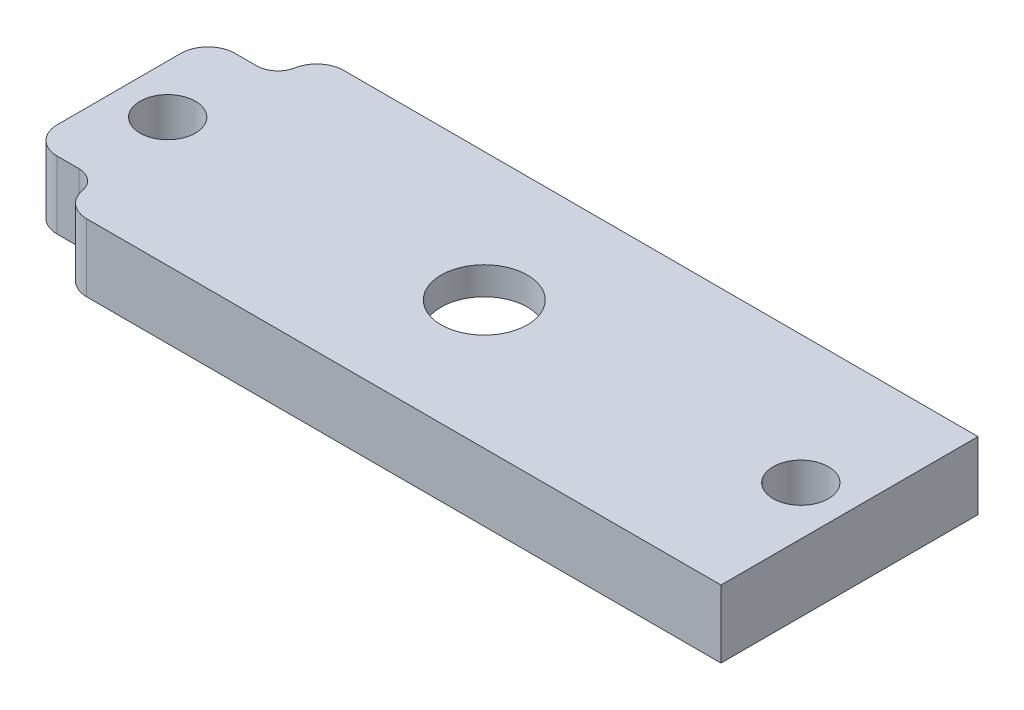
ISO-10303-21;
HEADER;
FILE_DESCRIPTION(('STEP AP214'),'2;1');
FILE_NAME('part.step','',(''),(''),'','','');
FILE_SCHEMA(('AUTOMOTIVE_DESIGN { 1 0 10303 214 1 1 1 1 }'));
ENDSEC;
DATA;
#1=APPLICATION_CONTEXT('core data for automotive mechanical design processes');
#2=APPLICATION_PROTOCOL_DEFINITION('international standard','automotive_design',2000,#1);
#3=PRODUCT_CONTEXT('',#1,'mechanical');
#4=PRODUCT('Part','Part','',(#3));
#5=PRODUCT_RELATED_PRODUCT_CATEGORY('part','',(#4));
#6=PRODUCT_DEFINITION_FORMATION('','',#4);
#7=PRODUCT_DEFINITION_CONTEXT('part definition',#1,'design');
#8=PRODUCT_DEFINITION('design','',#6,#7);
#9=PRODUCT_DEFINITION_SHAPE('','',#8);
#10=(LENGTH_UNIT() NAMED_UNIT(*) SI_UNIT(.MILLI.,.METRE.));
#11=(NAMED_UNIT(*) PLANE_ANGLE_UNIT() SI_UNIT($,.RADIAN.));
#12=(NAMED_UNIT(*) SI_UNIT($,.STERADIAN.) SOLID_ANGLE_UNIT());
#13=UNCERTAINTY_MEASURE_WITH_UNIT(LENGTH_MEASURE(1.E-05),#10,'distance_accuracy_value','');
#14=(GEOMETRIC_REPRESENTATION_CONTEXT(3) GLOBAL_UNCERTAINTY_ASSIGNED_CONTEXT((#13)) GLOBAL_UNIT_ASSIGNED_CONTEXT((#10,
#11,#12)) REPRESENTATION_CONTEXT('',''));
#15=CARTESIAN_POINT('',(0.,0.,0.));
#16=DIRECTION('',(0.,0.,1.));
#17=DIRECTION('',(1.,0.,0.));
#18=AXIS2_PLACEMENT_3D('',#15,#16,#17);
#19=CARTESIAN_POINT('',(0.,6.35,0.));
#20=DIRECTION('',(0.,-1.,0.));
#21=DIRECTION('',(0.,0.,-1.));
#22=AXIS2_PLACEMENT_3D('',#19,#20,#21);
#23=PLANE('',#22);
#24=CARTESIAN_POINT('',(34.29,6.35,-12.065));
#25=DIRECTION('',(0.,1.,0.));
#26=DIRECTION('',(0.,0.,1.));
#27=AXIS2_PLACEMENT_3D('',#24,#25,#26);
#28=CIRCLE('',#27,4.05);
#29=CARTESIAN_POINT('',(34.29,6.35,-8.015));
#30=VERTEX_POINT('',#29);
#31=EDGE_CURVE('E154',#30,#30,#28,.T.);
#32=ORIENTED_EDGE('',*,*,#31,.F.);
#33=EDGE_LOOP('',(#32));
#34=FACE_BOUND('',#33,.T.);
#35=CARTESIAN_POINT('',(4.57,6.35,-12.065));
#36=DIRECTION('',(0.,1.,0.));
#37=DIRECTION('',(0.,0.,1.));
#38=AXIS2_PLACEMENT_3D('',#35,#36,#37);
#39=CIRCLE('',#38,2.6);
#40=CARTESIAN_POINT('',(4.57,6.35,-9.465));
#41=VERTEX_POINT('',#40);
#42=EDGE_CURVE('E176',#41,#41,#39,.T.);
#43=ORIENTED_EDGE('',*,*,#42,.F.);
#44=EDGE_LOOP('',(#43));
#45=FACE_BOUND('',#44,.T.);
#46=CARTESIAN_POINT('',(64.01,6.35,-12.065));
#47=DIRECTION('',(0.,1.,0.));
#48=DIRECTION('',(0.,0.,1.));
#49=AXIS2_PLACEMENT_3D('',#46,#47,#48);
#50=CIRCLE('',#49,2.59999999999999);
#51=CARTESIAN_POINT('',(64.01,6.35,-9.46500000000001));
#52=VERTEX_POINT('',#51);
#53=EDGE_CURVE('E170',#52,#52,#50,.T.);
#54=ORIENTED_EDGE('',*,*,#53,.F.);
#55=EDGE_LOOP('',(#54));
#56=FACE_BOUND('',#55,.T.);
#57=CARTESIAN_POINT('',(4.57,6.35,-1.715));
#58=DIRECTION('',(0.,1.,0.));
#59=DIRECTION('',(0.,0.,1.));
#60=AXIS2_PLACEMENT_3D('',#57,#58,#59);
#61=CIRCLE('',#60,2.);
#62=CARTESIAN_POINT('',(4.57,6.35,-3.715));
#63=VERTEX_POINT('',#62);
#64=CARTESIAN_POINT('',(6.53670134597141,6.35,-2.07843612334802));
#65=VERTEX_POINT('',#64);
#66=EDGE_CURVE('E139',#63,#65,#61,.F.);
#67=ORIENTED_EDGE('',*,*,#66,.T.);
#68=CARTESIAN_POINT('',(9.03441205535511,6.35,-2.54));
#69=DIRECTION('',(0.,-1.,0.));
#70=DIRECTION('',(0.,0.,-1.));
#71=AXIS2_PLACEMENT_3D('',#68,#69,#70);
#72=CIRCLE('',#71,2.54);
#73=CARTESIAN_POINT('',(9.03441205535511,6.35,0.));
#74=VERTEX_POINT('',#73);
#75=EDGE_CURVE('E215',#65,#74,#72,.F.);
#76=ORIENTED_EDGE('',*,*,#75,.T.);
#77=DIRECTION('',(1.,0.,0.));
#78=VECTOR('',#77,1.);
#79=CARTESIAN_POINT('',(0.,6.35,0.));
#80=LINE('',#79,#78);
#81=CARTESIAN_POINT('',(68.58,6.35,0.));
#82=VERTEX_POINT('',#81);
#83=EDGE_CURVE('E185',#74,#82,#80,.T.);
#84=ORIENTED_EDGE('',*,*,#83,.T.);
#85=DIRECTION('',(0.,0.,-1.));
#86=VECTOR('',#85,1.);
#87=CARTESIAN_POINT('',(68.58,6.35,0.));
#88=LINE('',#87,#86);
#89=CARTESIAN_POINT('',(68.58,6.35,-24.13));
#90=VERTEX_POINT('',#89);
#91=EDGE_CURVE('E188',#82,#90,#88,.T.);
#92=ORIENTED_EDGE('',*,*,#91,.T.);
#93=DIRECTION('',(-1.,0.,0.));
#94=VECTOR('',#93,1.);
#95=CARTESIAN_POINT('',(0.,6.35,-24.13));
#96=LINE('',#95,#94);
#97=CARTESIAN_POINT('',(9.03441205535511,6.35,-24.13));
#98=VERTEX_POINT('',#97);
#99=EDGE_CURVE('E190',#90,#98,#96,.T.);
#100=ORIENTED_EDGE('',*,*,#99,.T.);
#101=CARTESIAN_POINT('',(9.03441205535511,6.35,-21.59));
#102=DIRECTION('',(0.,-1.,0.));
#103=DIRECTION('',(0.,0.,-1.));
#104=AXIS2_PLACEMENT_3D('',#101,#102,#103);
#105=CIRCLE('',#104,2.54);
#106=CARTESIAN_POINT('',(6.53670134597141,6.35,-22.051563876652));
#107=VERTEX_POINT('',#106);
#108=EDGE_CURVE('E209',#98,#107,#105,.F.);
#109=ORIENTED_EDGE('',*,*,#108,.T.);
#110=CARTESIAN_POINT('',(4.57,6.35,-22.415));
#111=DIRECTION('',(0.,1.,0.));
#112=DIRECTION('',(0.,0.,1.));
#113=AXIS2_PLACEMENT_3D('',#110,#111,#112);
#114=CIRCLE('',#113,2.);
#115=CARTESIAN_POINT('',(4.57,6.35,-20.415));
#116=VERTEX_POINT('',#115);
#117=EDGE_CURVE('E150',#116,#107,#114,.T.);
#118=ORIENTED_EDGE('',*,*,#117,.F.);
#119=DIRECTION('',(-1.,0.,0.));
#120=VECTOR('',#119,1.);
#121=CARTESIAN_POINT('',(0.,6.35,-20.415));
#122=LINE('',#121,#120);
#123=CARTESIAN_POINT('',(2.54,6.35,-20.415));
#124=VERTEX_POINT('',#123);
#125=EDGE_CURVE('E135',#116,#124,#122,.T.);
#126=ORIENTED_EDGE('',*,*,#125,.T.);
#127=CARTESIAN_POINT('',(2.54,6.35,-17.875));
#128=DIRECTION('',(0.,-1.,0.));
#129=DIRECTION('',(0.,0.,-1.));
#130=AXIS2_PLACEMENT_3D('',#127,#128,#129);
#131=CIRCLE('',#130,2.54);
#132=CARTESIAN_POINT('',(0.,6.35,-17.875));
#133=VERTEX_POINT('',#132);
#134=EDGE_CURVE('E211',#124,#133,#131,.F.);
#135=ORIENTED_EDGE('',*,*,#134,.T.);
#136=DIRECTION('',(0.,0.,1.));
#137=VECTOR('',#136,1.);
#138=CARTESIAN_POINT('',(0.,6.35,0.));
#139=LINE('',#138,#137);
#140=CARTESIAN_POINT('',(0.,6.35,-6.255));
#141=VERTEX_POINT('',#140);
#142=EDGE_CURVE('E182',#133,#141,#139,.T.);
#143=ORIENTED_EDGE('',*,*,#142,.T.);
#144=CARTESIAN_POINT('',(2.54,6.35,-6.255));
#145=DIRECTION('',(0.,-1.,0.));
#146=DIRECTION('',(0.,0.,-1.));
#147=AXIS2_PLACEMENT_3D('',#144,#145,#146);
#148=CIRCLE('',#147,2.54);
#149=CARTESIAN_POINT('',(2.54,6.35,-3.715));
#150=VERTEX_POINT('',#149);
#151=EDGE_CURVE('E213',#141,#150,#148,.F.);
#152=ORIENTED_EDGE('',*,*,#151,.T.);
#153=DIRECTION('',(-1.,0.,0.));
#154=VECTOR('',#153,1.);
#155=CARTESIAN_POINT('',(0.,6.35,-3.715));
#156=LINE('',#155,#154);
#157=EDGE_CURVE('E162',#63,#150,#156,.T.);
#158=ORIENTED_EDGE('',*,*,#157,.F.);
#159=EDGE_LOOP('',(#67,#76,#84,#92,#100,#109,#118,#126,#135,#143,#152,#158));
#160=FACE_BOUND('',#159,.T.);
#161=ADVANCED_FACE('F34',(#34,#45,#56,#160),#23,.F.);
#162=CARTESIAN_POINT('',(0.,0.,0.));
#163=DIRECTION('',(0.,-1.,0.));
#164=DIRECTION('',(0.,0.,-1.));
#165=AXIS2_PLACEMENT_3D('',#162,#163,#164);
#166=PLANE('',#165);
#167=CARTESIAN_POINT('',(34.29,0.,-12.065));
#168=DIRECTION('',(0.,1.,0.));
#169=DIRECTION('',(0.,0.,1.));
#170=AXIS2_PLACEMENT_3D('',#167,#168,#169);
#171=CIRCLE('',#170,10.065);
#172=CARTESIAN_POINT('',(34.29,0.,-2.));
#173=VERTEX_POINT('',#172);
#174=EDGE_CURVE('E436',#173,#173,#171,.T.);
#175=ORIENTED_EDGE('',*,*,#174,.T.);
#176=EDGE_LOOP('',(#175));
#177=FACE_BOUND('',#176,.T.);
#178=CARTESIAN_POINT('',(4.57,0.,-12.065));
#179=DIRECTION('',(0.,1.,0.));
#180=DIRECTION('',(0.,0.,1.));
#181=AXIS2_PLACEMENT_3D('',#178,#179,#180);
#182=CIRCLE('',#181,2.6);
#183=CARTESIAN_POINT('',(4.57,0.,-9.465));
#184=VERTEX_POINT('',#183);
#185=EDGE_CURVE('E173',#184,#184,#182,.T.);
#186=ORIENTED_EDGE('',*,*,#185,.T.);
#187=EDGE_LOOP('',(#186));
#188=FACE_BOUND('',#187,.T.);
#189=CARTESIAN_POINT('',(64.01,0.,-12.065));
#190=DIRECTION('',(0.,1.,0.));
#191=DIRECTION('',(0.,0.,1.));
#192=AXIS2_PLACEMENT_3D('',#189,#190,#191);
#193=CIRCLE('',#192,2.59999999999999);
#194=CARTESIAN_POINT('',(64.01,0.,-9.46500000000001));
#195=VERTEX_POINT('',#194);
#196=EDGE_CURVE('E169',#195,#195,#193,.T.);
#197=ORIENTED_EDGE('',*,*,#196,.T.);
#198=EDGE_LOOP('',(#197));
#199=FACE_BOUND('',#198,.T.);
#200=DIRECTION('',(1.,0.,0.));
#201=VECTOR('',#200,1.);
#202=CARTESIAN_POINT('',(0.,0.,0.));
#203=LINE('',#202,#201);
#204=CARTESIAN_POINT('',(9.03441205535511,0.,0.));
#205=VERTEX_POINT('',#204);
#206=CARTESIAN_POINT('',(68.58,0.,0.));
#207=VERTEX_POINT('',#206);
#208=EDGE_CURVE('E196',#205,#207,#203,.T.);
#209=ORIENTED_EDGE('',*,*,#208,.F.);
#210=CARTESIAN_POINT('',(9.03441205535511,0.,-2.54));
#211=DIRECTION('',(0.,-1.,0.));
#212=DIRECTION('',(0.,0.,-1.));
#213=AXIS2_PLACEMENT_3D('',#210,#211,#212);
#214=CIRCLE('',#213,2.54);
#215=CARTESIAN_POINT('',(6.53670134597141,0.,-2.07843612334802));
#216=VERTEX_POINT('',#215);
#217=EDGE_CURVE('E223',#205,#216,#214,.T.);
#218=ORIENTED_EDGE('',*,*,#217,.T.);
#219=CARTESIAN_POINT('',(4.57,0.,-1.715));
#220=DIRECTION('',(0.,1.,0.));
#221=DIRECTION('',(0.,0.,1.));
#222=AXIS2_PLACEMENT_3D('',#219,#220,#221);
#223=CIRCLE('',#222,2.);
#224=CARTESIAN_POINT('',(4.57,0.,-3.715));
#225=VERTEX_POINT('',#224);
#226=EDGE_CURVE('E158',#225,#216,#223,.F.);
#227=ORIENTED_EDGE('',*,*,#226,.F.);
#228=DIRECTION('',(-1.,0.,0.));
#229=VECTOR('',#228,1.);
#230=CARTESIAN_POINT('',(0.,0.,-3.715));
#231=LINE('',#230,#229);
#232=CARTESIAN_POINT('',(2.54,0.,-3.715));
#233=VERTEX_POINT('',#232);
#234=EDGE_CURVE('E161',#225,#233,#231,.T.);
#235=ORIENTED_EDGE('',*,*,#234,.T.);
#236=CARTESIAN_POINT('',(2.54,0.,-6.255));
#237=DIRECTION('',(0.,-1.,0.));
#238=DIRECTION('',(0.,0.,-1.));
#239=AXIS2_PLACEMENT_3D('',#236,#237,#238);
#240=CIRCLE('',#239,2.54);
#241=CARTESIAN_POINT('',(0.,0.,-6.255));
#242=VERTEX_POINT('',#241);
#243=EDGE_CURVE('E221',#233,#242,#240,.T.);
#244=ORIENTED_EDGE('',*,*,#243,.T.);
#245=DIRECTION('',(0.,0.,1.));
#246=VECTOR('',#245,1.);
#247=CARTESIAN_POINT('',(0.,0.,0.));
#248=LINE('',#247,#246);
#249=CARTESIAN_POINT('',(0.,0.,-17.875));
#250=VERTEX_POINT('',#249);
#251=EDGE_CURVE('E179',#250,#242,#248,.T.);
#252=ORIENTED_EDGE('',*,*,#251,.F.);
#253=CARTESIAN_POINT('',(2.54,0.,-17.875));
#254=DIRECTION('',(0.,-1.,0.));
#255=DIRECTION('',(0.,0.,-1.));
#256=AXIS2_PLACEMENT_3D('',#253,#254,#255);
#257=CIRCLE('',#256,2.54);
#258=CARTESIAN_POINT('',(2.54,0.,-20.415));
#259=VERTEX_POINT('',#258);
#260=EDGE_CURVE('E149',#250,#259,#257,.T.);
#261=ORIENTED_EDGE('',*,*,#260,.T.);
#262=DIRECTION('',(-1.,0.,0.));
#263=VECTOR('',#262,1.);
#264=CARTESIAN_POINT('',(0.,0.,-20.415));
#265=LINE('',#264,#263);
#266=CARTESIAN_POINT('',(4.57,0.,-20.415));
#267=VERTEX_POINT('',#266);
#268=EDGE_CURVE('E132',#267,#259,#265,.T.);
#269=ORIENTED_EDGE('',*,*,#268,.F.);
#270=CARTESIAN_POINT('',(4.57,0.,-22.415));
#271=DIRECTION('',(0.,1.,0.));
#272=DIRECTION('',(0.,0.,1.));
#273=AXIS2_PLACEMENT_3D('',#270,#271,#272);
#274=CIRCLE('',#273,2.);
#275=CARTESIAN_POINT('',(6.53670134597141,0.,-22.051563876652));
#276=VERTEX_POINT('',#275);
#277=EDGE_CURVE('E140',#267,#276,#274,.T.);
#278=ORIENTED_EDGE('',*,*,#277,.T.);
#279=CARTESIAN_POINT('',(9.03441205535511,0.,-21.59));
#280=DIRECTION('',(0.,-1.,0.));
#281=DIRECTION('',(0.,0.,-1.));
#282=AXIS2_PLACEMENT_3D('',#279,#280,#281);
#283=CIRCLE('',#282,2.54);
#284=CARTESIAN_POINT('',(9.03441205535511,0.,-24.13));
#285=VERTEX_POINT('',#284);
#286=EDGE_CURVE('E58',#276,#285,#283,.T.);
#287=ORIENTED_EDGE('',*,*,#286,.T.);
#288=DIRECTION('',(-1.,0.,0.));
#289=VECTOR('',#288,1.);
#290=CARTESIAN_POINT('',(0.,0.,-24.13));
#291=LINE('',#290,#289);
#292=CARTESIAN_POINT('',(68.58,0.,-24.13));
#293=VERTEX_POINT('',#292);
#294=EDGE_CURVE('E186',#293,#285,#291,.T.);
#295=ORIENTED_EDGE('',*,*,#294,.F.);
#296=DIRECTION('',(0.,0.,-1.));
#297=VECTOR('',#296,1.);
#298=CARTESIAN_POINT('',(68.58,0.,0.));
#299=LINE('',#298,#297);
#300=EDGE_CURVE('E198',#207,#293,#299,.T.);
#301=ORIENTED_EDGE('',*,*,#300,.F.);
#302=EDGE_LOOP('',(#209,#218,#227,#235,#244,#252,#261,#269,#278,#287,#295,#301));
#303=FACE_BOUND('',#302,.T.);
#304=ADVANCED_FACE('F146',(#177,#188,#199,#303),#166,.T.);
#305=CARTESIAN_POINT('',(0.,6.35,0.));
#306=DIRECTION('',(1.,0.,0.));
#307=DIRECTION('',(0.,0.,-1.));
#308=AXIS2_PLACEMENT_3D('',#305,#306,#307);
#309=PLANE('',#308);
#310=ORIENTED_EDGE('',*,*,#251,.T.);
#311=DIRECTION('',(0.,1.,0.));
#312=VECTOR('',#311,1.);
#313=CARTESIAN_POINT('',(0.,6.35,-6.255));
#314=LINE('',#313,#312);
#315=EDGE_CURVE('E227',#242,#141,#314,.T.);
#316=ORIENTED_EDGE('',*,*,#315,.T.);
#317=ORIENTED_EDGE('',*,*,#142,.F.);
#318=DIRECTION('',(0.,1.,0.));
#319=VECTOR('',#318,1.);
#320=CARTESIAN_POINT('',(0.,0.,-17.875));
#321=LINE('',#320,#319);
#322=EDGE_CURVE('E225',#133,#250,#321,.F.);
#323=ORIENTED_EDGE('',*,*,#322,.T.);
#324=EDGE_LOOP('',(#310,#316,#317,#323));
#325=FACE_BOUND('',#324,.T.);
#326=ADVANCED_FACE('F264',(#325),#309,.F.);
#327=CARTESIAN_POINT('',(0.,6.35,0.));
#328=DIRECTION('',(0.,0.,-1.));
#329=DIRECTION('',(-1.,0.,0.));
#330=AXIS2_PLACEMENT_3D('',#327,#328,#329);
#331=PLANE('',#330);
#332=ORIENTED_EDGE('',*,*,#83,.F.);
#333=DIRECTION('',(0.,-1.,0.));
#334=VECTOR('',#333,1.);
#335=CARTESIAN_POINT('',(9.03441205535511,0.,0.));
#336=LINE('',#335,#334);
#337=EDGE_CURVE('E217',#74,#205,#336,.T.);
#338=ORIENTED_EDGE('',*,*,#337,.T.);
#339=ORIENTED_EDGE('',*,*,#208,.T.);
#340=DIRECTION('',(0.,-1.,0.));
#341=VECTOR('',#340,1.);
#342=CARTESIAN_POINT('',(68.58,6.35,0.));
#343=LINE('',#342,#341);
#344=EDGE_CURVE('E203',#82,#207,#343,.T.);
#345=ORIENTED_EDGE('',*,*,#344,.F.);
#346=EDGE_LOOP('',(#332,#338,#339,#345));
#347=FACE_BOUND('',#346,.T.);
#348=ADVANCED_FACE('F296',(#347),#331,.F.);
#349=CARTESIAN_POINT('',(68.58,6.35,0.));
#350=DIRECTION('',(-1.,0.,0.));
#351=DIRECTION('',(0.,0.,1.));
#352=AXIS2_PLACEMENT_3D('',#349,#350,#351);
#353=PLANE('',#352);
#354=ORIENTED_EDGE('',*,*,#300,.T.);
#355=DIRECTION('',(0.,-1.,0.));
#356=VECTOR('',#355,1.);
#357=CARTESIAN_POINT('',(68.58,6.35,-24.13));
#358=LINE('',#357,#356);
#359=EDGE_CURVE('E193',#90,#293,#358,.T.);
#360=ORIENTED_EDGE('',*,*,#359,.F.);
#361=ORIENTED_EDGE('',*,*,#91,.F.);
#362=ORIENTED_EDGE('',*,*,#344,.T.);
#363=EDGE_LOOP('',(#354,#360,#361,#362));
#364=FACE_BOUND('',#363,.T.);
#365=ADVANCED_FACE('F245',(#364),#353,.F.);
#366=CARTESIAN_POINT('',(0.,6.35,-24.13));
#367=DIRECTION('',(0.,0.,1.));
#368=DIRECTION('',(1.,0.,0.));
#369=AXIS2_PLACEMENT_3D('',#366,#367,#368);
#370=PLANE('',#369);
#371=ORIENTED_EDGE('',*,*,#294,.T.);
#372=DIRECTION('',(0.,1.,0.));
#373=VECTOR('',#372,1.);
#374=CARTESIAN_POINT('',(9.03441205535511,6.35,-24.13));
#375=LINE('',#374,#373);
#376=EDGE_CURVE('E43',#285,#98,#375,.T.);
#377=ORIENTED_EDGE('',*,*,#376,.T.);
#378=ORIENTED_EDGE('',*,*,#99,.F.);
#379=ORIENTED_EDGE('',*,*,#359,.T.);
#380=EDGE_LOOP('',(#371,#377,#378,#379));
#381=FACE_BOUND('',#380,.T.);
#382=ADVANCED_FACE('F237',(#381),#370,.F.);
#383=CARTESIAN_POINT('',(4.57,6.35,-12.065));
#384=DIRECTION('',(0.,-1.,0.));
#385=DIRECTION('',(0.,0.,-1.));
#386=AXIS2_PLACEMENT_3D('',#383,#384,#385);
#387=CYLINDRICAL_SURFACE('',#386,2.6);
#388=ORIENTED_EDGE('',*,*,#42,.T.);
#389=EDGE_LOOP('',(#388));
#390=FACE_BOUND('',#389,.T.);
#391=ORIENTED_EDGE('',*,*,#185,.F.);
#392=EDGE_LOOP('',(#391));
#393=FACE_BOUND('',#392,.T.);
#394=ADVANCED_FACE('F289',(#390,#393),#387,.F.);
#395=CARTESIAN_POINT('',(64.01,6.35,-12.065));
#396=DIRECTION('',(0.,-1.,0.));
#397=DIRECTION('',(0.,0.,-1.));
#398=AXIS2_PLACEMENT_3D('',#395,#396,#397);
#399=CYLINDRICAL_SURFACE('',#398,2.59999999999999);
#400=ORIENTED_EDGE('',*,*,#53,.T.);
#401=EDGE_LOOP('',(#400));
#402=FACE_BOUND('',#401,.T.);
#403=ORIENTED_EDGE('',*,*,#196,.F.);
#404=EDGE_LOOP('',(#403));
#405=FACE_BOUND('',#404,.T.);
#406=ADVANCED_FACE('F345',(#402,#405),#399,.F.);
#407=CARTESIAN_POINT('',(4.57,0.,-1.715));
#408=DIRECTION('',(0.,1.,0.));
#409=DIRECTION('',(0.,0.,1.));
#410=AXIS2_PLACEMENT_3D('',#407,#408,#409);
#411=CYLINDRICAL_SURFACE('',#410,2.);
#412=ORIENTED_EDGE('',*,*,#226,.T.);
#413=DIRECTION('',(0.,1.,0.));
#414=VECTOR('',#413,1.);
#415=CARTESIAN_POINT('',(6.53670134597141,0.,-2.07843612334802));
#416=LINE('',#415,#414);
#417=EDGE_CURVE('E206',#216,#65,#416,.T.);
#418=ORIENTED_EDGE('',*,*,#417,.T.);
#419=ORIENTED_EDGE('',*,*,#66,.F.);
#420=DIRECTION('',(0.,1.,0.));
#421=VECTOR('',#420,1.);
#422=CARTESIAN_POINT('',(4.57,0.,-3.715));
#423=LINE('',#422,#421);
#424=EDGE_CURVE('E164',#225,#63,#423,.T.);
#425=ORIENTED_EDGE('',*,*,#424,.F.);
#426=EDGE_LOOP('',(#412,#418,#419,#425));
#427=FACE_BOUND('',#426,.T.);
#428=ADVANCED_FACE('F256',(#427),#411,.F.);
#429=CARTESIAN_POINT('',(0.,0.,-3.715));
#430=DIRECTION('',(0.,0.,-1.));
#431=DIRECTION('',(-1.,0.,0.));
#432=AXIS2_PLACEMENT_3D('',#429,#430,#431);
#433=PLANE('',#432);
#434=ORIENTED_EDGE('',*,*,#157,.T.);
#435=DIRECTION('',(0.,1.,0.));
#436=VECTOR('',#435,1.);
#437=CARTESIAN_POINT('',(2.54,0.,-3.715));
#438=LINE('',#437,#436);
#439=EDGE_CURVE('E50',#150,#233,#438,.F.);
#440=ORIENTED_EDGE('',*,*,#439,.T.);
#441=ORIENTED_EDGE('',*,*,#234,.F.);
#442=ORIENTED_EDGE('',*,*,#424,.T.);
#443=EDGE_LOOP('',(#434,#440,#441,#442));
#444=FACE_BOUND('',#443,.T.);
#445=ADVANCED_FACE('F258',(#444),#433,.F.);
#446=CARTESIAN_POINT('',(0.,0.,-20.415));
#447=DIRECTION('',(0.,0.,-1.));
#448=DIRECTION('',(-1.,0.,0.));
#449=AXIS2_PLACEMENT_3D('',#446,#447,#448);
#450=PLANE('',#449);
#451=ORIENTED_EDGE('',*,*,#268,.T.);
#452=DIRECTION('',(0.,1.,0.));
#453=VECTOR('',#452,1.);
#454=CARTESIAN_POINT('',(2.54,6.35,-20.415));
#455=LINE('',#454,#453);
#456=EDGE_CURVE('E231',#259,#124,#455,.T.);
#457=ORIENTED_EDGE('',*,*,#456,.T.);
#458=ORIENTED_EDGE('',*,*,#125,.F.);
#459=DIRECTION('',(0.,1.,0.));
#460=VECTOR('',#459,1.);
#461=CARTESIAN_POINT('',(4.57,0.,-20.415));
#462=LINE('',#461,#460);
#463=EDGE_CURVE('E127',#267,#116,#462,.T.);
#464=ORIENTED_EDGE('',*,*,#463,.F.);
#465=EDGE_LOOP('',(#451,#457,#458,#464));
#466=FACE_BOUND('',#465,.T.);
#467=ADVANCED_FACE('F129',(#466),#450,.T.);
#468=CARTESIAN_POINT('',(4.57,0.,-22.415));
#469=DIRECTION('',(0.,1.,0.));
#470=DIRECTION('',(0.,0.,1.));
#471=AXIS2_PLACEMENT_3D('',#468,#469,#470);
#472=CYLINDRICAL_SURFACE('',#471,2.);
#473=ORIENTED_EDGE('',*,*,#117,.T.);
#474=DIRECTION('',(0.,1.,0.));
#475=VECTOR('',#474,1.);
#476=CARTESIAN_POINT('',(6.53670134597141,0.,-22.051563876652));
#477=LINE('',#476,#475);
#478=EDGE_CURVE('E11',#107,#276,#477,.F.);
#479=ORIENTED_EDGE('',*,*,#478,.T.);
#480=ORIENTED_EDGE('',*,*,#277,.F.);
#481=ORIENTED_EDGE('',*,*,#463,.T.);
#482=EDGE_LOOP('',(#473,#479,#480,#481));
#483=FACE_BOUND('',#482,.T.);
#484=ADVANCED_FACE('F142',(#483),#472,.F.);
#485=CARTESIAN_POINT('',(9.03441205535511,0.,-2.54));
#486=DIRECTION('',(0.,1.,0.));
#487=DIRECTION('',(0.,0.,1.));
#488=AXIS2_PLACEMENT_3D('',#485,#486,#487);
#489=CYLINDRICAL_SURFACE('',#488,2.54);
#490=ORIENTED_EDGE('',*,*,#217,.F.);
#491=ORIENTED_EDGE('',*,*,#337,.F.);
#492=ORIENTED_EDGE('',*,*,#75,.F.);
#493=ORIENTED_EDGE('',*,*,#417,.F.);
#494=EDGE_LOOP('',(#490,#491,#492,#493));
#495=FACE_BOUND('',#494,.T.);
#496=ADVANCED_FACE('F253',(#495),#489,.T.);
#497=CARTESIAN_POINT('',(2.54,6.35,-6.255));
#498=DIRECTION('',(0.,1.,0.));
#499=DIRECTION('',(0.,0.,1.));
#500=AXIS2_PLACEMENT_3D('',#497,#498,#499);
#501=CYLINDRICAL_SURFACE('',#500,2.54);
#502=ORIENTED_EDGE('',*,*,#243,.F.);
#503=ORIENTED_EDGE('',*,*,#439,.F.);
#504=ORIENTED_EDGE('',*,*,#151,.F.);
#505=ORIENTED_EDGE('',*,*,#315,.F.);
#506=EDGE_LOOP('',(#502,#503,#504,#505));
#507=FACE_BOUND('',#506,.T.);
#508=ADVANCED_FACE('F261',(#507),#501,.T.);
#509=CARTESIAN_POINT('',(2.54,0.,-17.875));
#510=DIRECTION('',(0.,-1.,0.));
#511=DIRECTION('',(0.,0.,-1.));
#512=AXIS2_PLACEMENT_3D('',#509,#510,#511);
#513=CYLINDRICAL_SURFACE('',#512,2.54);
#514=ORIENTED_EDGE('',*,*,#260,.F.);
#515=ORIENTED_EDGE('',*,*,#322,.F.);
#516=ORIENTED_EDGE('',*,*,#134,.F.);
#517=ORIENTED_EDGE('',*,*,#456,.F.);
#518=EDGE_LOOP('',(#514,#515,#516,#517));
#519=FACE_BOUND('',#518,.T.);
#520=ADVANCED_FACE('F268',(#519),#513,.T.);
#521=CARTESIAN_POINT('',(9.03441205535511,0.,-21.59));
#522=DIRECTION('',(0.,1.,0.));
#523=DIRECTION('',(0.,0.,1.));
#524=AXIS2_PLACEMENT_3D('',#521,#522,#523);
#525=CYLINDRICAL_SURFACE('',#524,2.54);
#526=ORIENTED_EDGE('',*,*,#286,.F.);
#527=ORIENTED_EDGE('',*,*,#478,.F.);
#528=ORIENTED_EDGE('',*,*,#108,.F.);
#529=ORIENTED_EDGE('',*,*,#376,.F.);
#530=EDGE_LOOP('',(#526,#527,#528,#529));
#531=FACE_BOUND('',#530,.T.);
#532=ADVANCED_FACE('F36',(#531),#525,.T.);
#533=CARTESIAN_POINT('',(34.29,0.,-12.065));
#534=DIRECTION('',(0.,1.,0.));
#535=DIRECTION('',(0.,0.,1.));
#536=AXIS2_PLACEMENT_3D('',#533,#534,#535);
#537=CYLINDRICAL_SURFACE('',#536,4.05);
#538=CARTESIAN_POINT('',(34.29,3.74320873951238,-12.065));
#539=DIRECTION('',(0.,-1.,0.));
#540=DIRECTION('',(0.,0.,-1.));
#541=AXIS2_PLACEMENT_3D('',#538,#539,#540);
#542=CIRCLE('',#541,4.05);
#543=CARTESIAN_POINT('',(34.29,3.74320873951238,-16.115));
#544=VERTEX_POINT('',#543);
#545=EDGE_CURVE('E38',#544,#544,#542,.T.);
#546=ORIENTED_EDGE('',*,*,#545,.T.);
#547=EDGE_LOOP('',(#546));
#548=FACE_BOUND('',#547,.T.);
#549=ORIENTED_EDGE('',*,*,#31,.T.);
#550=EDGE_LOOP('',(#549));
#551=FACE_BOUND('',#550,.T.);
#552=ADVANCED_FACE('F270',(#548,#551),#537,.F.);
#553=CARTESIAN_POINT('',(34.29,-9.46916379310344,-12.065));
#554=DIRECTION('',(0.,1.,0.));
#555=DIRECTION('',(0.,0.,-1.));
#556=AXIS2_PLACEMENT_3D('',#553,#554,#555);
#557=SPHERICAL_SURFACE('',#556,13.8191637931034);
#558=ORIENTED_EDGE('',*,*,#174,.F.);
#559=EDGE_LOOP('',(#558));
#560=FACE_BOUND('',#559,.T.);
#561=ORIENTED_EDGE('',*,*,#545,.F.);
#562=EDGE_LOOP('',(#561));
#563=FACE_BOUND('',#562,.T.);
#564=ADVANCED_FACE('F275',(#560,#563),#557,.F.);
#565=CLOSED_SHELL('',(#161,#304,#326,#348,#365,#382,#394,#406,#428,#445,#467,#484,#496,#508,
#520,#532,#552,#564));
#566=MANIFOLD_SOLID_BREP('B2',#565);
#567=ADVANCED_BREP_SHAPE_REPRESENTATION('',(#18,#566),#14);
#568=SHAPE_DEFINITION_REPRESENTATION(#9,#567);
ENDSEC;
END-ISO-10303-21;
